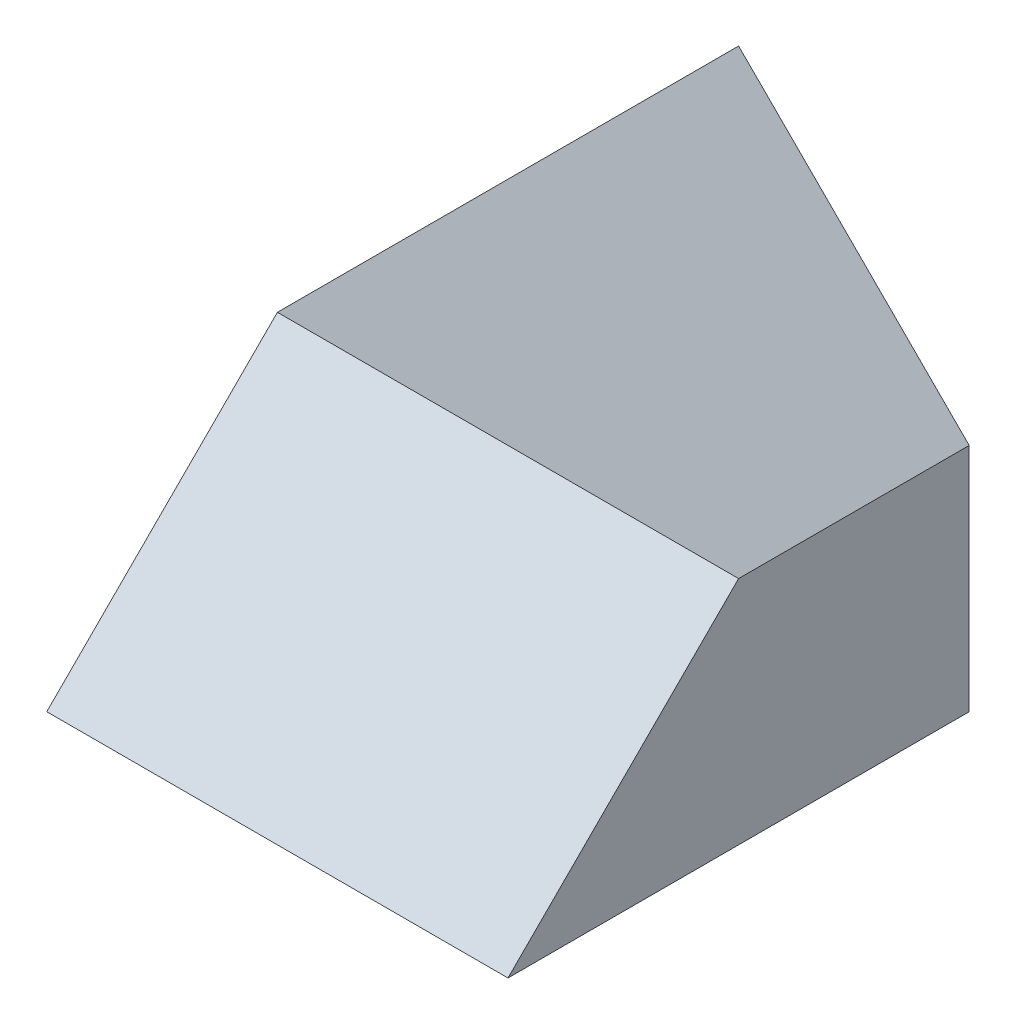
ISO-10303-21;
HEADER;
FILE_DESCRIPTION(('STEP AP214'),'2;1');
FILE_NAME('part.step','',(''),(''),'','','');
FILE_SCHEMA(('AUTOMOTIVE_DESIGN { 1 0 10303 214 1 1 1 1 }'));
ENDSEC;
DATA;
#1=APPLICATION_CONTEXT('core data for automotive mechanical design processes');
#2=APPLICATION_PROTOCOL_DEFINITION('international standard','automotive_design',2000,#1);
#3=PRODUCT_CONTEXT('',#1,'mechanical');
#4=PRODUCT('Part','Part','',(#3));
#5=PRODUCT_RELATED_PRODUCT_CATEGORY('part','',(#4));
#6=PRODUCT_DEFINITION_FORMATION('','',#4);
#7=PRODUCT_DEFINITION_CONTEXT('part definition',#1,'design');
#8=PRODUCT_DEFINITION('design','',#6,#7);
#9=PRODUCT_DEFINITION_SHAPE('','',#8);
#10=(LENGTH_UNIT() NAMED_UNIT(*) SI_UNIT(.MILLI.,.METRE.));
#11=(NAMED_UNIT(*) PLANE_ANGLE_UNIT() SI_UNIT($,.RADIAN.));
#12=(NAMED_UNIT(*) SI_UNIT($,.STERADIAN.) SOLID_ANGLE_UNIT());
#13=UNCERTAINTY_MEASURE_WITH_UNIT(LENGTH_MEASURE(1.E-05),#10,'distance_accuracy_value','');
#14=(GEOMETRIC_REPRESENTATION_CONTEXT(3) GLOBAL_UNCERTAINTY_ASSIGNED_CONTEXT((#13)) GLOBAL_UNIT_ASSIGNED_CONTEXT((#10,
#11,#12)) REPRESENTATION_CONTEXT('',''));
#15=CARTESIAN_POINT('',(0.,0.,0.));
#16=DIRECTION('',(0.,0.,1.));
#17=DIRECTION('',(1.,0.,0.));
#18=AXIS2_PLACEMENT_3D('',#15,#16,#17);
#19=CARTESIAN_POINT('',(-2.,4.,-2.));
#20=DIRECTION('',(0.,0.,1.));
#21=DIRECTION('',(1.,0.,0.));
#22=AXIS2_PLACEMENT_3D('',#19,#20,#21);
#23=PLANE('',#22);
#24=DIRECTION('',(0.707106781186548,-0.707106781186548,0.));
#25=VECTOR('',#24,1.);
#26=CARTESIAN_POINT('',(2.,2.,-2.));
#27=LINE('',#26,#25);
#28=CARTESIAN_POINT('',(0.,4.,-2.));
#29=VERTEX_POINT('',#28);
#30=CARTESIAN_POINT('',(2.,2.,-2.));
#31=VERTEX_POINT('',#30);
#32=EDGE_CURVE('E106',#29,#31,#27,.T.);
#33=ORIENTED_EDGE('',*,*,#32,.T.);
#34=DIRECTION('',(0.,-1.,0.));
#35=VECTOR('',#34,1.);
#36=CARTESIAN_POINT('',(2.,4.,-2.));
#37=LINE('',#36,#35);
#38=CARTESIAN_POINT('',(2.,0.,-2.));
#39=VERTEX_POINT('',#38);
#40=EDGE_CURVE('E60',#31,#39,#37,.T.);
#41=ORIENTED_EDGE('',*,*,#40,.T.);
#42=DIRECTION('',(-1.,0.,0.));
#43=VECTOR('',#42,1.);
#44=CARTESIAN_POINT('',(-2.,0.,-2.));
#45=LINE('',#44,#43);
#46=CARTESIAN_POINT('',(-2.,0.,-2.));
#47=VERTEX_POINT('',#46);
#48=EDGE_CURVE('E132',#39,#47,#45,.T.);
#49=ORIENTED_EDGE('',*,*,#48,.T.);
#50=DIRECTION('',(0.,-1.,0.));
#51=VECTOR('',#50,1.);
#52=CARTESIAN_POINT('',(-2.,4.,-2.));
#53=LINE('',#52,#51);
#54=CARTESIAN_POINT('',(-2.,2.,-2.));
#55=VERTEX_POINT('',#54);
#56=EDGE_CURVE('E74',#55,#47,#53,.T.);
#57=ORIENTED_EDGE('',*,*,#56,.F.);
#58=DIRECTION('',(0.707106781186548,0.707106781186548,0.));
#59=VECTOR('',#58,1.);
#60=CARTESIAN_POINT('',(-2.,2.,-2.));
#61=LINE('',#60,#59);
#62=EDGE_CURVE('E117',#55,#29,#61,.T.);
#63=ORIENTED_EDGE('',*,*,#62,.T.);
#64=EDGE_LOOP('',(#33,#41,#49,#57,#63));
#65=FACE_BOUND('',#64,.T.);
#66=ADVANCED_FACE('F52',(#65),#23,.F.);
#67=CARTESIAN_POINT('',(2.,4.,2.));
#68=DIRECTION('',(0.,0.707106781186548,-0.707106781186547));
#69=DIRECTION('',(0.,0.707106781186547,0.707106781186548));
#70=AXIS2_PLACEMENT_3D('',#67,#68,#69);
#71=PLANE('',#70);
#72=DIRECTION('',(0.577350269189626,-0.577350269189626,-0.577350269189626));
#73=VECTOR('',#72,1.);
#74=CARTESIAN_POINT('',(0.666666666666666,3.33333333333333,1.33333333333333));
#75=LINE('',#74,#73);
#76=CARTESIAN_POINT('',(0.,4.,2.));
#77=VERTEX_POINT('',#76);
#78=CARTESIAN_POINT('',(2.,2.,0.));
#79=VERTEX_POINT('',#78);
#80=EDGE_CURVE('E103',#77,#79,#75,.T.);
#81=ORIENTED_EDGE('',*,*,#80,.F.);
#82=DIRECTION('',(0.577350269189626,0.577350269189626,0.577350269189626));
#83=VECTOR('',#82,1.);
#84=CARTESIAN_POINT('',(0.666666666666666,4.66666666666667,2.66666666666667));
#85=LINE('',#84,#83);
#86=CARTESIAN_POINT('',(-2.,2.,0.));
#87=VERTEX_POINT('',#86);
#88=EDGE_CURVE('E12',#87,#77,#85,.T.);
#89=ORIENTED_EDGE('',*,*,#88,.F.);
#90=DIRECTION('',(-1.,0.,0.));
#91=VECTOR('',#90,1.);
#92=CARTESIAN_POINT('',(2.,2.,0.));
#93=LINE('',#92,#91);
#94=EDGE_CURVE('E115',#79,#87,#93,.T.);
#95=ORIENTED_EDGE('',*,*,#94,.F.);
#96=EDGE_LOOP('',(#81,#89,#95));
#97=FACE_BOUND('',#96,.T.);
#98=ADVANCED_FACE('F114',(#97),#71,.F.);
#99=CARTESIAN_POINT('',(2.,4.,2.));
#100=DIRECTION('',(-1.,0.,0.));
#101=DIRECTION('',(0.,0.,1.));
#102=AXIS2_PLACEMENT_3D('',#99,#100,#101);
#103=PLANE('',#102);
#104=DIRECTION('',(0.,0.,-1.));
#105=VECTOR('',#104,1.);
#106=CARTESIAN_POINT('',(2.,2.,2.));
#107=LINE('',#106,#105);
#108=EDGE_CURVE('E118',#79,#31,#107,.T.);
#109=ORIENTED_EDGE('',*,*,#108,.F.);
#110=DIRECTION('',(0.,-0.707106781186547,0.707106781186548));
#111=VECTOR('',#110,1.);
#112=CARTESIAN_POINT('',(2.,2.,0.));
#113=LINE('',#112,#111);
#114=CARTESIAN_POINT('',(2.,0.,2.));
#115=VERTEX_POINT('',#114);
#116=EDGE_CURVE('E124',#79,#115,#113,.T.);
#117=ORIENTED_EDGE('',*,*,#116,.T.);
#118=DIRECTION('',(0.,0.,-1.));
#119=VECTOR('',#118,1.);
#120=CARTESIAN_POINT('',(2.,0.,2.));
#121=LINE('',#120,#119);
#122=EDGE_CURVE('E129',#115,#39,#121,.T.);
#123=ORIENTED_EDGE('',*,*,#122,.T.);
#124=ORIENTED_EDGE('',*,*,#40,.F.);
#125=EDGE_LOOP('',(#109,#117,#123,#124));
#126=FACE_BOUND('',#125,.T.);
#127=ADVANCED_FACE('F54',(#126),#103,.F.);
#128=CARTESIAN_POINT('',(-2.,4.,2.));
#129=DIRECTION('',(1.,0.,0.));
#130=DIRECTION('',(0.,0.,-1.));
#131=AXIS2_PLACEMENT_3D('',#128,#129,#130);
#132=PLANE('',#131);
#133=DIRECTION('',(0.,0.,-1.));
#134=VECTOR('',#133,1.);
#135=CARTESIAN_POINT('',(-2.,2.,2.));
#136=LINE('',#135,#134);
#137=EDGE_CURVE('E109',#87,#55,#136,.T.);
#138=ORIENTED_EDGE('',*,*,#137,.T.);
#139=ORIENTED_EDGE('',*,*,#56,.T.);
#140=DIRECTION('',(0.,0.,1.));
#141=VECTOR('',#140,1.);
#142=CARTESIAN_POINT('',(-2.,0.,2.));
#143=LINE('',#142,#141);
#144=CARTESIAN_POINT('',(-2.,0.,2.));
#145=VERTEX_POINT('',#144);
#146=EDGE_CURVE('E134',#47,#145,#143,.T.);
#147=ORIENTED_EDGE('',*,*,#146,.T.);
#148=DIRECTION('',(0.,-0.707106781186547,0.707106781186548));
#149=VECTOR('',#148,1.);
#150=CARTESIAN_POINT('',(-2.,2.,0.));
#151=LINE('',#150,#149);
#152=EDGE_CURVE('E67',#87,#145,#151,.T.);
#153=ORIENTED_EDGE('',*,*,#152,.F.);
#154=EDGE_LOOP('',(#138,#139,#147,#153));
#155=FACE_BOUND('',#154,.T.);
#156=ADVANCED_FACE('F148',(#155),#132,.F.);
#157=CARTESIAN_POINT('',(0.,0.,0.));
#158=DIRECTION('',(0.,-1.,0.));
#159=DIRECTION('',(0.,0.,-1.));
#160=AXIS2_PLACEMENT_3D('',#157,#158,#159);
#161=PLANE('',#160);
#162=ORIENTED_EDGE('',*,*,#122,.F.);
#163=DIRECTION('',(1.,0.,0.));
#164=VECTOR('',#163,1.);
#165=CARTESIAN_POINT('',(-2.,0.,2.));
#166=LINE('',#165,#164);
#167=EDGE_CURVE('E136',#145,#115,#166,.T.);
#168=ORIENTED_EDGE('',*,*,#167,.F.);
#169=ORIENTED_EDGE('',*,*,#146,.F.);
#170=ORIENTED_EDGE('',*,*,#48,.F.);
#171=EDGE_LOOP('',(#162,#168,#169,#170));
#172=FACE_BOUND('',#171,.T.);
#173=ADVANCED_FACE('F145',(#172),#161,.T.);
#174=CARTESIAN_POINT('',(2.,2.,0.));
#175=DIRECTION('',(0.,-0.707106781186548,-0.707106781186547));
#176=DIRECTION('',(0.,0.707106781186547,-0.707106781186548));
#177=AXIS2_PLACEMENT_3D('',#174,#175,#176);
#178=PLANE('',#177);
#179=ORIENTED_EDGE('',*,*,#152,.T.);
#180=ORIENTED_EDGE('',*,*,#167,.T.);
#181=ORIENTED_EDGE('',*,*,#116,.F.);
#182=ORIENTED_EDGE('',*,*,#94,.T.);
#183=EDGE_LOOP('',(#179,#180,#181,#182));
#184=FACE_BOUND('',#183,.T.);
#185=ADVANCED_FACE('F147',(#184),#178,.F.);
#186=CARTESIAN_POINT('',(-2.,2.,2.));
#187=DIRECTION('',(-0.707106781186547,0.707106781186547,0.));
#188=DIRECTION('',(-0.707106781186548,-0.707106781186548,0.));
#189=AXIS2_PLACEMENT_3D('',#186,#187,#188);
#190=PLANE('',#189);
#191=ORIENTED_EDGE('',*,*,#88,.T.);
#192=DIRECTION('',(0.,0.,-1.));
#193=VECTOR('',#192,1.);
#194=CARTESIAN_POINT('',(0.,4.,2.));
#195=LINE('',#194,#193);
#196=EDGE_CURVE('E100',#77,#29,#195,.T.);
#197=ORIENTED_EDGE('',*,*,#196,.T.);
#198=ORIENTED_EDGE('',*,*,#62,.F.);
#199=ORIENTED_EDGE('',*,*,#137,.F.);
#200=EDGE_LOOP('',(#191,#197,#198,#199));
#201=FACE_BOUND('',#200,.T.);
#202=ADVANCED_FACE('F120',(#201),#190,.T.);
#203=CARTESIAN_POINT('',(2.,2.,2.));
#204=DIRECTION('',(0.707106781186547,0.707106781186547,0.));
#205=DIRECTION('',(-0.707106781186548,0.707106781186548,0.));
#206=AXIS2_PLACEMENT_3D('',#203,#204,#205);
#207=PLANE('',#206);
#208=ORIENTED_EDGE('',*,*,#80,.T.);
#209=ORIENTED_EDGE('',*,*,#108,.T.);
#210=ORIENTED_EDGE('',*,*,#32,.F.);
#211=ORIENTED_EDGE('',*,*,#196,.F.);
#212=EDGE_LOOP('',(#208,#209,#210,#211));
#213=FACE_BOUND('',#212,.T.);
#214=ADVANCED_FACE('F102',(#213),#207,.T.);
#215=CLOSED_SHELL('',(#66,#98,#127,#156,#173,#185,#202,#214));
#216=MANIFOLD_SOLID_BREP('B2',#215);
#217=ADVANCED_BREP_SHAPE_REPRESENTATION('',(#18,#216),#14);
#218=SHAPE_DEFINITION_REPRESENTATION(#9,#217);
ENDSEC;
END-ISO-10303-21;
